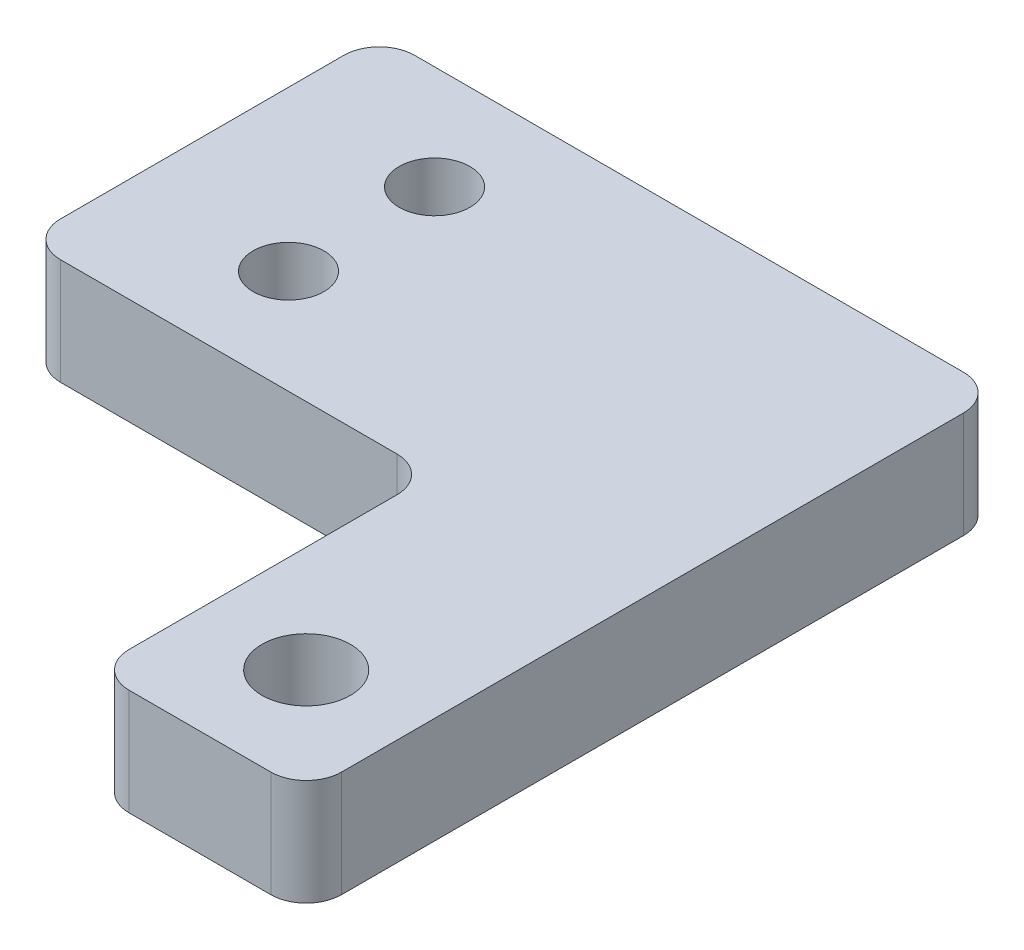
ISO-10303-21;
HEADER;
FILE_DESCRIPTION(('STEP AP214'),'2;1');
FILE_NAME('part.step','',(''),(''),'','','');
FILE_SCHEMA(('AUTOMOTIVE_DESIGN { 1 0 10303 214 1 1 1 1 }'));
ENDSEC;
DATA;
#1=APPLICATION_CONTEXT('core data for automotive mechanical design processes');
#2=APPLICATION_PROTOCOL_DEFINITION('international standard','automotive_design',2000,#1);
#3=PRODUCT_CONTEXT('',#1,'mechanical');
#4=PRODUCT('Part','Part','',(#3));
#5=PRODUCT_RELATED_PRODUCT_CATEGORY('part','',(#4));
#6=PRODUCT_DEFINITION_FORMATION('','',#4);
#7=PRODUCT_DEFINITION_CONTEXT('part definition',#1,'design');
#8=PRODUCT_DEFINITION('design','',#6,#7);
#9=PRODUCT_DEFINITION_SHAPE('','',#8);
#10=(LENGTH_UNIT() NAMED_UNIT(*) SI_UNIT(.MILLI.,.METRE.));
#11=(NAMED_UNIT(*) PLANE_ANGLE_UNIT() SI_UNIT($,.RADIAN.));
#12=(NAMED_UNIT(*) SI_UNIT($,.STERADIAN.) SOLID_ANGLE_UNIT());
#13=UNCERTAINTY_MEASURE_WITH_UNIT(LENGTH_MEASURE(1.E-05),#10,'distance_accuracy_value','');
#14=(GEOMETRIC_REPRESENTATION_CONTEXT(3) GLOBAL_UNCERTAINTY_ASSIGNED_CONTEXT((#13)) GLOBAL_UNIT_ASSIGNED_CONTEXT((#10,
#11,#12)) REPRESENTATION_CONTEXT('',''));
#15=CARTESIAN_POINT('',(0.,0.,0.));
#16=DIRECTION('',(0.,0.,1.));
#17=DIRECTION('',(1.,0.,0.));
#18=AXIS2_PLACEMENT_3D('',#15,#16,#17);
#19=CARTESIAN_POINT('',(0.,6.,0.));
#20=DIRECTION('',(0.,1.,0.));
#21=DIRECTION('',(0.,0.,1.));
#22=AXIS2_PLACEMENT_3D('',#19,#20,#21);
#23=PLANE('',#22);
#24=CARTESIAN_POINT('',(0.,6.,0.));
#25=DIRECTION('',(0.,1.,0.));
#26=DIRECTION('',(0.,0.,1.));
#27=AXIS2_PLACEMENT_3D('',#24,#25,#26);
#28=CIRCLE('',#27,2.);
#29=CARTESIAN_POINT('',(0.,6.,2.));
#30=VERTEX_POINT('',#29);
#31=EDGE_CURVE('E288',#30,#30,#28,.T.);
#32=ORIENTED_EDGE('',*,*,#31,.F.);
#33=EDGE_LOOP('',(#32));
#34=FACE_BOUND('',#33,.T.);
#35=DIRECTION('',(0.,0.,1.));
#36=VECTOR('',#35,1.);
#37=CARTESIAN_POINT('',(14.,6.,5.875));
#38=LINE('',#37,#36);
#39=CARTESIAN_POINT('',(14.,6.,7.875));
#40=VERTEX_POINT('',#39);
#41=CARTESIAN_POINT('',(14.,6.,23.));
#42=VERTEX_POINT('',#41);
#43=EDGE_CURVE('E178',#40,#42,#38,.T.);
#44=ORIENTED_EDGE('',*,*,#43,.T.);
#45=CARTESIAN_POINT('',(16.,6.,23.));
#46=DIRECTION('',(0.,1.,0.));
#47=DIRECTION('',(0.,0.,1.));
#48=AXIS2_PLACEMENT_3D('',#45,#46,#47);
#49=CIRCLE('',#48,2.);
#50=CARTESIAN_POINT('',(16.,6.,25.));
#51=VERTEX_POINT('',#50);
#52=EDGE_CURVE('E222',#42,#51,#49,.T.);
#53=ORIENTED_EDGE('',*,*,#52,.T.);
#54=DIRECTION('',(1.,0.,0.));
#55=VECTOR('',#54,1.);
#56=CARTESIAN_POINT('',(14.,6.,25.));
#57=LINE('',#56,#55);
#58=CARTESIAN_POINT('',(24.,6.,25.));
#59=VERTEX_POINT('',#58);
#60=EDGE_CURVE('E155',#51,#59,#57,.T.);
#61=ORIENTED_EDGE('',*,*,#60,.T.);
#62=CARTESIAN_POINT('',(24.,6.,23.));
#63=DIRECTION('',(0.,1.,0.));
#64=DIRECTION('',(0.,0.,1.));
#65=AXIS2_PLACEMENT_3D('',#62,#63,#64);
#66=CIRCLE('',#65,2.);
#67=CARTESIAN_POINT('',(26.,6.,23.));
#68=VERTEX_POINT('',#67);
#69=EDGE_CURVE('E219',#59,#68,#66,.T.);
#70=ORIENTED_EDGE('',*,*,#69,.T.);
#71=DIRECTION('',(0.,0.,-1.));
#72=VECTOR('',#71,1.);
#73=CARTESIAN_POINT('',(26.,6.,25.));
#74=LINE('',#73,#72);
#75=CARTESIAN_POINT('',(26.,6.,-12.125));
#76=VERTEX_POINT('',#75);
#77=EDGE_CURVE('E280',#68,#76,#74,.T.);
#78=ORIENTED_EDGE('',*,*,#77,.T.);
#79=CARTESIAN_POINT('',(24.,6.,-12.125));
#80=DIRECTION('',(0.,1.,0.));
#81=DIRECTION('',(0.,0.,1.));
#82=AXIS2_PLACEMENT_3D('',#79,#80,#81);
#83=CIRCLE('',#82,2.);
#84=CARTESIAN_POINT('',(24.,6.,-14.125));
#85=VERTEX_POINT('',#84);
#86=EDGE_CURVE('E216',#76,#85,#83,.T.);
#87=ORIENTED_EDGE('',*,*,#86,.T.);
#88=DIRECTION('',(-1.,0.,0.));
#89=VECTOR('',#88,1.);
#90=CARTESIAN_POINT('',(26.,6.,-14.125));
#91=LINE('',#90,#89);
#92=CARTESIAN_POINT('',(-7.,6.,-14.125));
#93=VERTEX_POINT('',#92);
#94=EDGE_CURVE('E274',#85,#93,#91,.T.);
#95=ORIENTED_EDGE('',*,*,#94,.T.);
#96=CARTESIAN_POINT('',(-7.,6.,-12.125));
#97=DIRECTION('',(0.,1.,0.));
#98=DIRECTION('',(0.,0.,1.));
#99=AXIS2_PLACEMENT_3D('',#96,#97,#98);
#100=CIRCLE('',#99,2.);
#101=CARTESIAN_POINT('',(-9.,6.,-12.125));
#102=VERTEX_POINT('',#101);
#103=EDGE_CURVE('E213',#93,#102,#100,.T.);
#104=ORIENTED_EDGE('',*,*,#103,.T.);
#105=DIRECTION('',(0.,0.,1.));
#106=VECTOR('',#105,1.);
#107=CARTESIAN_POINT('',(-9.,6.,-14.125));
#108=LINE('',#107,#106);
#109=CARTESIAN_POINT('',(-9.,6.,3.875));
#110=VERTEX_POINT('',#109);
#111=EDGE_CURVE('E270',#102,#110,#108,.T.);
#112=ORIENTED_EDGE('',*,*,#111,.T.);
#113=CARTESIAN_POINT('',(-7.,6.,3.875));
#114=DIRECTION('',(0.,1.,0.));
#115=DIRECTION('',(0.,0.,1.));
#116=AXIS2_PLACEMENT_3D('',#113,#114,#115);
#117=CIRCLE('',#116,2.);
#118=CARTESIAN_POINT('',(-7.,6.,5.875));
#119=VERTEX_POINT('',#118);
#120=EDGE_CURVE('E66',#110,#119,#117,.T.);
#121=ORIENTED_EDGE('',*,*,#120,.T.);
#122=DIRECTION('',(1.,0.,0.));
#123=VECTOR('',#122,1.);
#124=CARTESIAN_POINT('',(-9.,6.,5.875));
#125=LINE('',#124,#123);
#126=CARTESIAN_POINT('',(12.,6.,5.875));
#127=VERTEX_POINT('',#126);
#128=EDGE_CURVE('E263',#119,#127,#125,.T.);
#129=ORIENTED_EDGE('',*,*,#128,.T.);
#130=CARTESIAN_POINT('',(12.,6.,7.875));
#131=DIRECTION('',(0.,1.,0.));
#132=DIRECTION('',(0.,0.,1.));
#133=AXIS2_PLACEMENT_3D('',#130,#131,#132);
#134=CIRCLE('',#133,2.);
#135=EDGE_CURVE('E11',#127,#40,#134,.F.);
#136=ORIENTED_EDGE('',*,*,#135,.T.);
#137=EDGE_LOOP('',(#44,#53,#61,#70,#78,#87,#95,#104,#112,#121,#129,#136));
#138=FACE_BOUND('',#137,.T.);
#139=CARTESIAN_POINT('',(0.,6.,-8.25));
#140=DIRECTION('',(0.,1.,0.));
#141=DIRECTION('',(0.,0.,1.));
#142=AXIS2_PLACEMENT_3D('',#139,#140,#141);
#143=CIRCLE('',#142,2.);
#144=CARTESIAN_POINT('',(0.,6.,-6.25));
#145=VERTEX_POINT('',#144);
#146=EDGE_CURVE('E165',#145,#145,#143,.T.);
#147=ORIENTED_EDGE('',*,*,#146,.F.);
#148=EDGE_LOOP('',(#147));
#149=FACE_BOUND('',#148,.T.);
#150=CARTESIAN_POINT('',(20.,6.,19.));
#151=DIRECTION('',(0.,1.,0.));
#152=DIRECTION('',(0.,0.,1.));
#153=AXIS2_PLACEMENT_3D('',#150,#151,#152);
#154=CIRCLE('',#153,2.5);
#155=CARTESIAN_POINT('',(20.,6.,21.5));
#156=VERTEX_POINT('',#155);
#157=EDGE_CURVE('E294',#156,#156,#154,.T.);
#158=ORIENTED_EDGE('',*,*,#157,.F.);
#159=EDGE_LOOP('',(#158));
#160=FACE_BOUND('',#159,.T.);
#161=ADVANCED_FACE('F43',(#34,#138,#149,#160),#23,.T.);
#162=CARTESIAN_POINT('',(0.,0.,0.));
#163=DIRECTION('',(0.,1.,0.));
#164=DIRECTION('',(0.,0.,1.));
#165=AXIS2_PLACEMENT_3D('',#162,#163,#164);
#166=PLANE('',#165);
#167=DIRECTION('',(1.,0.,0.));
#168=VECTOR('',#167,1.);
#169=CARTESIAN_POINT('',(14.,0.,25.));
#170=LINE('',#169,#168);
#171=CARTESIAN_POINT('',(16.,0.,25.));
#172=VERTEX_POINT('',#171);
#173=CARTESIAN_POINT('',(24.,0.,25.));
#174=VERTEX_POINT('',#173);
#175=EDGE_CURVE('E152',#172,#174,#170,.T.);
#176=ORIENTED_EDGE('',*,*,#175,.F.);
#177=CARTESIAN_POINT('',(16.,0.,23.));
#178=DIRECTION('',(0.,1.,0.));
#179=DIRECTION('',(0.,0.,1.));
#180=AXIS2_PLACEMENT_3D('',#177,#178,#179);
#181=CIRCLE('',#180,2.);
#182=CARTESIAN_POINT('',(14.,0.,23.));
#183=VERTEX_POINT('',#182);
#184=EDGE_CURVE('E134',#172,#183,#181,.F.);
#185=ORIENTED_EDGE('',*,*,#184,.T.);
#186=DIRECTION('',(0.,0.,1.));
#187=VECTOR('',#186,1.);
#188=CARTESIAN_POINT('',(14.,0.,5.875));
#189=LINE('',#188,#187);
#190=CARTESIAN_POINT('',(14.,0.,7.875));
#191=VERTEX_POINT('',#190);
#192=EDGE_CURVE('E191',#191,#183,#189,.T.);
#193=ORIENTED_EDGE('',*,*,#192,.F.);
#194=CARTESIAN_POINT('',(12.,0.,7.875));
#195=DIRECTION('',(0.,1.,0.));
#196=DIRECTION('',(0.,0.,1.));
#197=AXIS2_PLACEMENT_3D('',#194,#195,#196);
#198=CIRCLE('',#197,2.);
#199=CARTESIAN_POINT('',(12.,0.,5.875));
#200=VERTEX_POINT('',#199);
#201=EDGE_CURVE('E52',#191,#200,#198,.T.);
#202=ORIENTED_EDGE('',*,*,#201,.T.);
#203=DIRECTION('',(1.,0.,0.));
#204=VECTOR('',#203,1.);
#205=CARTESIAN_POINT('',(-9.,0.,5.875));
#206=LINE('',#205,#204);
#207=CARTESIAN_POINT('',(-7.,0.,5.875));
#208=VERTEX_POINT('',#207);
#209=EDGE_CURVE('E188',#208,#200,#206,.T.);
#210=ORIENTED_EDGE('',*,*,#209,.F.);
#211=CARTESIAN_POINT('',(-7.,0.,3.875));
#212=DIRECTION('',(0.,1.,0.));
#213=DIRECTION('',(0.,0.,1.));
#214=AXIS2_PLACEMENT_3D('',#211,#212,#213);
#215=CIRCLE('',#214,2.);
#216=CARTESIAN_POINT('',(-9.,0.,3.875));
#217=VERTEX_POINT('',#216);
#218=EDGE_CURVE('E157',#208,#217,#215,.F.);
#219=ORIENTED_EDGE('',*,*,#218,.T.);
#220=DIRECTION('',(0.,0.,1.));
#221=VECTOR('',#220,1.);
#222=CARTESIAN_POINT('',(-9.,0.,-14.125));
#223=LINE('',#222,#221);
#224=CARTESIAN_POINT('',(-9.,0.,-12.125));
#225=VERTEX_POINT('',#224);
#226=EDGE_CURVE('E184',#225,#217,#223,.T.);
#227=ORIENTED_EDGE('',*,*,#226,.F.);
#228=CARTESIAN_POINT('',(-7.,0.,-12.125));
#229=DIRECTION('',(0.,1.,0.));
#230=DIRECTION('',(0.,0.,1.));
#231=AXIS2_PLACEMENT_3D('',#228,#229,#230);
#232=CIRCLE('',#231,2.);
#233=CARTESIAN_POINT('',(-7.,0.,-14.125));
#234=VERTEX_POINT('',#233);
#235=EDGE_CURVE('E198',#225,#234,#232,.F.);
#236=ORIENTED_EDGE('',*,*,#235,.T.);
#237=DIRECTION('',(-1.,0.,0.));
#238=VECTOR('',#237,1.);
#239=CARTESIAN_POINT('',(26.,0.,-14.125));
#240=LINE('',#239,#238);
#241=CARTESIAN_POINT('',(24.,0.,-14.125));
#242=VERTEX_POINT('',#241);
#243=EDGE_CURVE('E172',#242,#234,#240,.T.);
#244=ORIENTED_EDGE('',*,*,#243,.F.);
#245=CARTESIAN_POINT('',(24.,0.,-12.125));
#246=DIRECTION('',(0.,1.,0.));
#247=DIRECTION('',(0.,0.,1.));
#248=AXIS2_PLACEMENT_3D('',#245,#246,#247);
#249=CIRCLE('',#248,2.);
#250=CARTESIAN_POINT('',(26.,0.,-12.125));
#251=VERTEX_POINT('',#250);
#252=EDGE_CURVE('E201',#242,#251,#249,.F.);
#253=ORIENTED_EDGE('',*,*,#252,.T.);
#254=DIRECTION('',(0.,0.,-1.));
#255=VECTOR('',#254,1.);
#256=CARTESIAN_POINT('',(26.,0.,25.));
#257=LINE('',#256,#255);
#258=CARTESIAN_POINT('',(26.,0.,23.));
#259=VERTEX_POINT('',#258);
#260=EDGE_CURVE('E164',#259,#251,#257,.T.);
#261=ORIENTED_EDGE('',*,*,#260,.F.);
#262=CARTESIAN_POINT('',(24.,0.,23.));
#263=DIRECTION('',(0.,1.,0.));
#264=DIRECTION('',(0.,0.,1.));
#265=AXIS2_PLACEMENT_3D('',#262,#263,#264);
#266=CIRCLE('',#265,2.);
#267=EDGE_CURVE('E146',#259,#174,#266,.F.);
#268=ORIENTED_EDGE('',*,*,#267,.T.);
#269=EDGE_LOOP('',(#176,#185,#193,#202,#210,#219,#227,#236,#244,#253,#261,#268));
#270=FACE_BOUND('',#269,.T.);
#271=CARTESIAN_POINT('',(0.,0.,-8.25));
#272=DIRECTION('',(0.,1.,0.));
#273=DIRECTION('',(0.,0.,1.));
#274=AXIS2_PLACEMENT_3D('',#271,#272,#273);
#275=CIRCLE('',#274,2.);
#276=CARTESIAN_POINT('',(0.,0.,-6.25));
#277=VERTEX_POINT('',#276);
#278=EDGE_CURVE('E175',#277,#277,#275,.T.);
#279=ORIENTED_EDGE('',*,*,#278,.T.);
#280=EDGE_LOOP('',(#279));
#281=FACE_BOUND('',#280,.T.);
#282=CARTESIAN_POINT('',(0.,0.,0.));
#283=DIRECTION('',(0.,1.,0.));
#284=DIRECTION('',(0.,0.,1.));
#285=AXIS2_PLACEMENT_3D('',#282,#283,#284);
#286=CIRCLE('',#285,2.);
#287=CARTESIAN_POINT('',(0.,0.,2.));
#288=VERTEX_POINT('',#287);
#289=EDGE_CURVE('E290',#288,#288,#286,.T.);
#290=ORIENTED_EDGE('',*,*,#289,.T.);
#291=EDGE_LOOP('',(#290));
#292=FACE_BOUND('',#291,.T.);
#293=CARTESIAN_POINT('',(20.,0.,19.));
#294=DIRECTION('',(0.,1.,0.));
#295=DIRECTION('',(0.,0.,1.));
#296=AXIS2_PLACEMENT_3D('',#293,#294,#295);
#297=CIRCLE('',#296,2.5);
#298=CARTESIAN_POINT('',(20.,0.,21.5));
#299=VERTEX_POINT('',#298);
#300=EDGE_CURVE('E298',#299,#299,#297,.T.);
#301=ORIENTED_EDGE('',*,*,#300,.T.);
#302=EDGE_LOOP('',(#301));
#303=FACE_BOUND('',#302,.T.);
#304=ADVANCED_FACE('F160',(#270,#281,#292,#303),#166,.F.);
#305=CARTESIAN_POINT('',(14.,6.,25.));
#306=DIRECTION('',(0.,0.,-1.));
#307=DIRECTION('',(-1.,0.,0.));
#308=AXIS2_PLACEMENT_3D('',#305,#306,#307);
#309=PLANE('',#308);
#310=ORIENTED_EDGE('',*,*,#60,.F.);
#311=DIRECTION('',(0.,-1.,0.));
#312=VECTOR('',#311,1.);
#313=CARTESIAN_POINT('',(16.,6.,25.));
#314=LINE('',#313,#312);
#315=EDGE_CURVE('E138',#51,#172,#314,.T.);
#316=ORIENTED_EDGE('',*,*,#315,.T.);
#317=ORIENTED_EDGE('',*,*,#175,.T.);
#318=DIRECTION('',(0.,-1.,0.));
#319=VECTOR('',#318,1.);
#320=CARTESIAN_POINT('',(24.,6.,25.));
#321=LINE('',#320,#319);
#322=EDGE_CURVE('E158',#174,#59,#321,.F.);
#323=ORIENTED_EDGE('',*,*,#322,.T.);
#324=EDGE_LOOP('',(#310,#316,#317,#323));
#325=FACE_BOUND('',#324,.T.);
#326=ADVANCED_FACE('F151',(#325),#309,.F.);
#327=CARTESIAN_POINT('',(26.,6.,25.));
#328=DIRECTION('',(-1.,0.,0.));
#329=DIRECTION('',(0.,0.,1.));
#330=AXIS2_PLACEMENT_3D('',#327,#328,#329);
#331=PLANE('',#330);
#332=ORIENTED_EDGE('',*,*,#77,.F.);
#333=DIRECTION('',(0.,-1.,0.));
#334=VECTOR('',#333,1.);
#335=CARTESIAN_POINT('',(26.,6.,23.));
#336=LINE('',#335,#334);
#337=EDGE_CURVE('E228',#68,#259,#336,.T.);
#338=ORIENTED_EDGE('',*,*,#337,.T.);
#339=ORIENTED_EDGE('',*,*,#260,.T.);
#340=DIRECTION('',(0.,-1.,0.));
#341=VECTOR('',#340,1.);
#342=CARTESIAN_POINT('',(26.,6.,-12.125));
#343=LINE('',#342,#341);
#344=EDGE_CURVE('E225',#251,#76,#343,.F.);
#345=ORIENTED_EDGE('',*,*,#344,.T.);
#346=EDGE_LOOP('',(#332,#338,#339,#345));
#347=FACE_BOUND('',#346,.T.);
#348=ADVANCED_FACE('F334',(#347),#331,.F.);
#349=CARTESIAN_POINT('',(26.,6.,-14.125));
#350=DIRECTION('',(0.,0.,1.));
#351=DIRECTION('',(1.,0.,0.));
#352=AXIS2_PLACEMENT_3D('',#349,#350,#351);
#353=PLANE('',#352);
#354=ORIENTED_EDGE('',*,*,#94,.F.);
#355=DIRECTION('',(0.,-1.,0.));
#356=VECTOR('',#355,1.);
#357=CARTESIAN_POINT('',(24.,6.,-14.125));
#358=LINE('',#357,#356);
#359=EDGE_CURVE('E235',#85,#242,#358,.T.);
#360=ORIENTED_EDGE('',*,*,#359,.T.);
#361=ORIENTED_EDGE('',*,*,#243,.T.);
#362=DIRECTION('',(0.,-1.,0.));
#363=VECTOR('',#362,1.);
#364=CARTESIAN_POINT('',(-7.,6.,-14.125));
#365=LINE('',#364,#363);
#366=EDGE_CURVE('E232',#234,#93,#365,.F.);
#367=ORIENTED_EDGE('',*,*,#366,.T.);
#368=EDGE_LOOP('',(#354,#360,#361,#367));
#369=FACE_BOUND('',#368,.T.);
#370=ADVANCED_FACE('F330',(#369),#353,.F.);
#371=CARTESIAN_POINT('',(-9.,6.,-14.125));
#372=DIRECTION('',(1.,0.,0.));
#373=DIRECTION('',(0.,0.,-1.));
#374=AXIS2_PLACEMENT_3D('',#371,#372,#373);
#375=PLANE('',#374);
#376=ORIENTED_EDGE('',*,*,#111,.F.);
#377=DIRECTION('',(0.,-1.,0.));
#378=VECTOR('',#377,1.);
#379=CARTESIAN_POINT('',(-9.,6.,-12.125));
#380=LINE('',#379,#378);
#381=EDGE_CURVE('E242',#102,#225,#380,.T.);
#382=ORIENTED_EDGE('',*,*,#381,.T.);
#383=ORIENTED_EDGE('',*,*,#226,.T.);
#384=DIRECTION('',(0.,-1.,0.));
#385=VECTOR('',#384,1.);
#386=CARTESIAN_POINT('',(-9.,6.,3.875));
#387=LINE('',#386,#385);
#388=EDGE_CURVE('E239',#217,#110,#387,.F.);
#389=ORIENTED_EDGE('',*,*,#388,.T.);
#390=EDGE_LOOP('',(#376,#382,#383,#389));
#391=FACE_BOUND('',#390,.T.);
#392=ADVANCED_FACE('F327',(#391),#375,.F.);
#393=CARTESIAN_POINT('',(-9.,6.,5.875));
#394=DIRECTION('',(0.,0.,-1.));
#395=DIRECTION('',(-1.,0.,0.));
#396=AXIS2_PLACEMENT_3D('',#393,#394,#395);
#397=PLANE('',#396);
#398=ORIENTED_EDGE('',*,*,#128,.F.);
#399=DIRECTION('',(0.,-1.,0.));
#400=VECTOR('',#399,1.);
#401=CARTESIAN_POINT('',(-7.,6.,5.875));
#402=LINE('',#401,#400);
#403=EDGE_CURVE('E248',#119,#208,#402,.T.);
#404=ORIENTED_EDGE('',*,*,#403,.T.);
#405=ORIENTED_EDGE('',*,*,#209,.T.);
#406=DIRECTION('',(0.,-1.,0.));
#407=VECTOR('',#406,1.);
#408=CARTESIAN_POINT('',(12.,6.,5.875));
#409=LINE('',#408,#407);
#410=EDGE_CURVE('E59',#200,#127,#409,.F.);
#411=ORIENTED_EDGE('',*,*,#410,.T.);
#412=EDGE_LOOP('',(#398,#404,#405,#411));
#413=FACE_BOUND('',#412,.T.);
#414=ADVANCED_FACE('F257',(#413),#397,.F.);
#415=CARTESIAN_POINT('',(14.,6.,5.875));
#416=DIRECTION('',(1.,0.,0.));
#417=DIRECTION('',(0.,0.,-1.));
#418=AXIS2_PLACEMENT_3D('',#415,#416,#417);
#419=PLANE('',#418);
#420=ORIENTED_EDGE('',*,*,#192,.T.);
#421=DIRECTION('',(0.,-1.,0.));
#422=VECTOR('',#421,1.);
#423=CARTESIAN_POINT('',(14.,6.,23.));
#424=LINE('',#423,#422);
#425=EDGE_CURVE('E139',#183,#42,#424,.F.);
#426=ORIENTED_EDGE('',*,*,#425,.T.);
#427=ORIENTED_EDGE('',*,*,#43,.F.);
#428=DIRECTION('',(0.,-1.,0.));
#429=VECTOR('',#428,1.);
#430=CARTESIAN_POINT('',(14.,0.,7.875));
#431=LINE('',#430,#429);
#432=EDGE_CURVE('E145',#40,#191,#431,.T.);
#433=ORIENTED_EDGE('',*,*,#432,.T.);
#434=EDGE_LOOP('',(#420,#426,#427,#433));
#435=FACE_BOUND('',#434,.T.);
#436=ADVANCED_FACE('F265',(#435),#419,.F.);
#437=CARTESIAN_POINT('',(0.,6.,-8.25));
#438=DIRECTION('',(0.,-1.,0.));
#439=DIRECTION('',(0.,0.,-1.));
#440=AXIS2_PLACEMENT_3D('',#437,#438,#439);
#441=CYLINDRICAL_SURFACE('',#440,2.);
#442=ORIENTED_EDGE('',*,*,#146,.T.);
#443=EDGE_LOOP('',(#442));
#444=FACE_BOUND('',#443,.T.);
#445=ORIENTED_EDGE('',*,*,#278,.F.);
#446=EDGE_LOOP('',(#445));
#447=FACE_BOUND('',#446,.T.);
#448=ADVANCED_FACE('F320',(#444,#447),#441,.F.);
#449=CARTESIAN_POINT('',(0.,6.,0.));
#450=DIRECTION('',(0.,-1.,0.));
#451=DIRECTION('',(0.,0.,-1.));
#452=AXIS2_PLACEMENT_3D('',#449,#450,#451);
#453=CYLINDRICAL_SURFACE('',#452,2.);
#454=ORIENTED_EDGE('',*,*,#31,.T.);
#455=EDGE_LOOP('',(#454));
#456=FACE_BOUND('',#455,.T.);
#457=ORIENTED_EDGE('',*,*,#289,.F.);
#458=EDGE_LOOP('',(#457));
#459=FACE_BOUND('',#458,.T.);
#460=ADVANCED_FACE('F414',(#456,#459),#453,.F.);
#461=CARTESIAN_POINT('',(20.,6.,19.));
#462=DIRECTION('',(0.,-1.,0.));
#463=DIRECTION('',(0.,0.,-1.));
#464=AXIS2_PLACEMENT_3D('',#461,#462,#463);
#465=CYLINDRICAL_SURFACE('',#464,2.5);
#466=ORIENTED_EDGE('',*,*,#157,.T.);
#467=EDGE_LOOP('',(#466));
#468=FACE_BOUND('',#467,.T.);
#469=ORIENTED_EDGE('',*,*,#300,.F.);
#470=EDGE_LOOP('',(#469));
#471=FACE_BOUND('',#470,.T.);
#472=ADVANCED_FACE('F308',(#468,#471),#465,.F.);
#473=CARTESIAN_POINT('',(16.,6.,23.));
#474=DIRECTION('',(0.,-1.,0.));
#475=DIRECTION('',(0.,0.,-1.));
#476=AXIS2_PLACEMENT_3D('',#473,#474,#475);
#477=CYLINDRICAL_SURFACE('',#476,2.);
#478=ORIENTED_EDGE('',*,*,#52,.F.);
#479=ORIENTED_EDGE('',*,*,#425,.F.);
#480=ORIENTED_EDGE('',*,*,#184,.F.);
#481=ORIENTED_EDGE('',*,*,#315,.F.);
#482=EDGE_LOOP('',(#478,#479,#480,#481));
#483=FACE_BOUND('',#482,.T.);
#484=ADVANCED_FACE('F137',(#483),#477,.T.);
#485=CARTESIAN_POINT('',(24.,6.,23.));
#486=DIRECTION('',(0.,-1.,0.));
#487=DIRECTION('',(0.,0.,-1.));
#488=AXIS2_PLACEMENT_3D('',#485,#486,#487);
#489=CYLINDRICAL_SURFACE('',#488,2.);
#490=ORIENTED_EDGE('',*,*,#69,.F.);
#491=ORIENTED_EDGE('',*,*,#322,.F.);
#492=ORIENTED_EDGE('',*,*,#267,.F.);
#493=ORIENTED_EDGE('',*,*,#337,.F.);
#494=EDGE_LOOP('',(#490,#491,#492,#493));
#495=FACE_BOUND('',#494,.T.);
#496=ADVANCED_FACE('F343',(#495),#489,.T.);
#497=CARTESIAN_POINT('',(24.,6.,-12.125));
#498=DIRECTION('',(0.,-1.,0.));
#499=DIRECTION('',(0.,0.,-1.));
#500=AXIS2_PLACEMENT_3D('',#497,#498,#499);
#501=CYLINDRICAL_SURFACE('',#500,2.);
#502=ORIENTED_EDGE('',*,*,#86,.F.);
#503=ORIENTED_EDGE('',*,*,#344,.F.);
#504=ORIENTED_EDGE('',*,*,#252,.F.);
#505=ORIENTED_EDGE('',*,*,#359,.F.);
#506=EDGE_LOOP('',(#502,#503,#504,#505));
#507=FACE_BOUND('',#506,.T.);
#508=ADVANCED_FACE('F346',(#507),#501,.T.);
#509=CARTESIAN_POINT('',(-7.,6.,-12.125));
#510=DIRECTION('',(0.,-1.,0.));
#511=DIRECTION('',(0.,0.,-1.));
#512=AXIS2_PLACEMENT_3D('',#509,#510,#511);
#513=CYLINDRICAL_SURFACE('',#512,2.);
#514=ORIENTED_EDGE('',*,*,#103,.F.);
#515=ORIENTED_EDGE('',*,*,#366,.F.);
#516=ORIENTED_EDGE('',*,*,#235,.F.);
#517=ORIENTED_EDGE('',*,*,#381,.F.);
#518=EDGE_LOOP('',(#514,#515,#516,#517));
#519=FACE_BOUND('',#518,.T.);
#520=ADVANCED_FACE('F350',(#519),#513,.T.);
#521=CARTESIAN_POINT('',(-7.,6.,3.875));
#522=DIRECTION('',(0.,-1.,0.));
#523=DIRECTION('',(0.,0.,-1.));
#524=AXIS2_PLACEMENT_3D('',#521,#522,#523);
#525=CYLINDRICAL_SURFACE('',#524,2.);
#526=ORIENTED_EDGE('',*,*,#120,.F.);
#527=ORIENTED_EDGE('',*,*,#388,.F.);
#528=ORIENTED_EDGE('',*,*,#218,.F.);
#529=ORIENTED_EDGE('',*,*,#403,.F.);
#530=EDGE_LOOP('',(#526,#527,#528,#529));
#531=FACE_BOUND('',#530,.T.);
#532=ADVANCED_FACE('F353',(#531),#525,.T.);
#533=CARTESIAN_POINT('',(12.,6.,7.875));
#534=DIRECTION('',(0.,1.,0.));
#535=DIRECTION('',(0.,0.,1.));
#536=AXIS2_PLACEMENT_3D('',#533,#534,#535);
#537=CYLINDRICAL_SURFACE('',#536,2.);
#538=ORIENTED_EDGE('',*,*,#135,.F.);
#539=ORIENTED_EDGE('',*,*,#410,.F.);
#540=ORIENTED_EDGE('',*,*,#201,.F.);
#541=ORIENTED_EDGE('',*,*,#432,.F.);
#542=EDGE_LOOP('',(#538,#539,#540,#541));
#543=FACE_BOUND('',#542,.T.);
#544=ADVANCED_FACE('F45',(#543),#537,.F.);
#545=CLOSED_SHELL('',(#161,#304,#326,#348,#370,#392,#414,#436,#448,#460,#472,#484,#496,#508,
#520,#532,#544));
#546=MANIFOLD_SOLID_BREP('B2',#545);
#547=ADVANCED_BREP_SHAPE_REPRESENTATION('',(#18,#546),#14);
#548=SHAPE_DEFINITION_REPRESENTATION(#9,#547);
ENDSEC;
END-ISO-10303-21;
